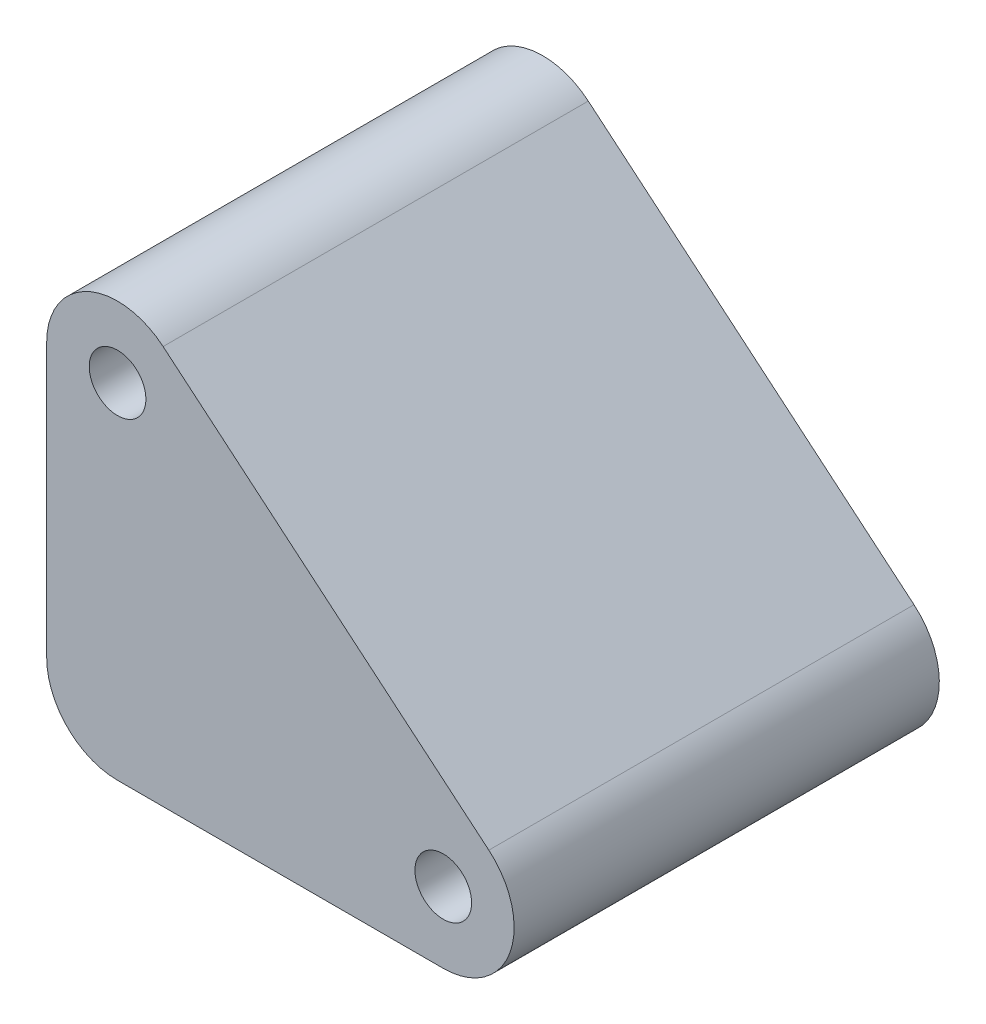
ISO-10303-21;
HEADER;
FILE_DESCRIPTION(('STEP AP214'),'2;1');
FILE_NAME('part.step','',(''),(''),'','','');
FILE_SCHEMA(('AUTOMOTIVE_DESIGN { 1 0 10303 214 1 1 1 1 }'));
ENDSEC;
DATA;
#1=APPLICATION_CONTEXT('core data for automotive mechanical design processes');
#2=APPLICATION_PROTOCOL_DEFINITION('international standard','automotive_design',2000,#1);
#3=PRODUCT_CONTEXT('',#1,'mechanical');
#4=PRODUCT('Part','Part','',(#3));
#5=PRODUCT_RELATED_PRODUCT_CATEGORY('part','',(#4));
#6=PRODUCT_DEFINITION_FORMATION('','',#4);
#7=PRODUCT_DEFINITION_CONTEXT('part definition',#1,'design');
#8=PRODUCT_DEFINITION('design','',#6,#7);
#9=PRODUCT_DEFINITION_SHAPE('','',#8);
#10=(LENGTH_UNIT() NAMED_UNIT(*) SI_UNIT(.MILLI.,.METRE.));
#11=(NAMED_UNIT(*) PLANE_ANGLE_UNIT() SI_UNIT($,.RADIAN.));
#12=(NAMED_UNIT(*) SI_UNIT($,.STERADIAN.) SOLID_ANGLE_UNIT());
#13=UNCERTAINTY_MEASURE_WITH_UNIT(LENGTH_MEASURE(1.E-05),#10,'distance_accuracy_value','');
#14=(GEOMETRIC_REPRESENTATION_CONTEXT(3) GLOBAL_UNCERTAINTY_ASSIGNED_CONTEXT((#13)) GLOBAL_UNIT_ASSIGNED_CONTEXT((#10,
#11,#12)) REPRESENTATION_CONTEXT('',''));
#15=CARTESIAN_POINT('',(0.,0.,0.));
#16=DIRECTION('',(0.,0.,1.));
#17=DIRECTION('',(1.,0.,0.));
#18=AXIS2_PLACEMENT_3D('',#15,#16,#17);
#19=CARTESIAN_POINT('',(-253.944054728592,61.0658585954254,-15.));
#20=DIRECTION('',(0.,0.,1.));
#21=DIRECTION('',(1.,0.,0.));
#22=AXIS2_PLACEMENT_3D('',#19,#20,#21);
#23=CYLINDRICAL_SURFACE('',#22,5.00000000000001);
#24=DIRECTION('',(0.,0.,1.));
#25=VECTOR('',#24,1.);
#26=CARTESIAN_POINT('',(-258.944054728592,61.0658585954254,-15.));
#27=LINE('',#26,#25);
#28=CARTESIAN_POINT('',(-258.944054728592,61.0658585954254,-15.));
#29=VERTEX_POINT('',#28);
#30=CARTESIAN_POINT('',(-258.944054728592,61.0658585954254,15.));
#31=VERTEX_POINT('',#30);
#32=EDGE_CURVE('E36',#29,#31,#27,.T.);
#33=ORIENTED_EDGE('',*,*,#32,.T.);
#34=CARTESIAN_POINT('',(-253.944054728592,61.0658585954254,15.));
#35=DIRECTION('',(0.,0.,1.));
#36=DIRECTION('',(1.,0.,0.));
#37=AXIS2_PLACEMENT_3D('',#34,#35,#36);
#38=CIRCLE('',#37,5.00000000000001);
#39=CARTESIAN_POINT('',(-250.730116680159,64.8960808110203,15.));
#40=VERTEX_POINT('',#39);
#41=EDGE_CURVE('E85',#40,#31,#38,.T.);
#42=ORIENTED_EDGE('',*,*,#41,.F.);
#43=DIRECTION('',(0.,0.,1.));
#44=VECTOR('',#43,1.);
#45=CARTESIAN_POINT('',(-250.730116680159,64.8960808110203,-15.));
#46=LINE('',#45,#44);
#47=CARTESIAN_POINT('',(-250.730116680159,64.8960808110203,-15.));
#48=VERTEX_POINT('',#47);
#49=EDGE_CURVE('E11',#48,#40,#46,.T.);
#50=ORIENTED_EDGE('',*,*,#49,.F.);
#51=CARTESIAN_POINT('',(-253.944054728592,61.0658585954254,-15.));
#52=DIRECTION('',(0.,0.,1.));
#53=DIRECTION('',(1.,0.,0.));
#54=AXIS2_PLACEMENT_3D('',#51,#52,#53);
#55=CIRCLE('',#54,5.00000000000001);
#56=EDGE_CURVE('E86',#48,#29,#55,.T.);
#57=ORIENTED_EDGE('',*,*,#56,.T.);
#58=EDGE_LOOP('',(#33,#42,#50,#57));
#59=FACE_BOUND('',#58,.T.);
#60=ADVANCED_FACE('F33',(#59),#23,.T.);
#61=CARTESIAN_POINT('',(-250.730116680159,64.8960808110203,-15.));
#62=DIRECTION('',(0.642787609686541,0.766044443118977,0.));
#63=DIRECTION('',(-0.766044443118977,0.642787609686541,0.));
#64=AXIS2_PLACEMENT_3D('',#61,#62,#63);
#65=PLANE('',#64);
#66=ORIENTED_EDGE('',*,*,#49,.T.);
#67=DIRECTION('',(-0.766044443118977,0.642787609686541,0.));
#68=VECTOR('',#67,1.);
#69=CARTESIAN_POINT('',(-250.730116680159,64.8960808110203,15.));
#70=LINE('',#69,#68);
#71=CARTESIAN_POINT('',(-227.74878338659,45.6124525204241,15.));
#72=VERTEX_POINT('',#71);
#73=EDGE_CURVE('E104',#72,#40,#70,.T.);
#74=ORIENTED_EDGE('',*,*,#73,.F.);
#75=DIRECTION('',(0.,0.,1.));
#76=VECTOR('',#75,1.);
#77=CARTESIAN_POINT('',(-227.74878338659,45.6124525204241,-15.));
#78=LINE('',#77,#76);
#79=CARTESIAN_POINT('',(-227.74878338659,45.6124525204241,-15.));
#80=VERTEX_POINT('',#79);
#81=EDGE_CURVE('E41',#80,#72,#78,.T.);
#82=ORIENTED_EDGE('',*,*,#81,.F.);
#83=DIRECTION('',(-0.766044443118977,0.642787609686541,0.));
#84=VECTOR('',#83,1.);
#85=CARTESIAN_POINT('',(-250.730116680159,64.8960808110203,-15.));
#86=LINE('',#85,#84);
#87=EDGE_CURVE('E91',#80,#48,#86,.T.);
#88=ORIENTED_EDGE('',*,*,#87,.T.);
#89=EDGE_LOOP('',(#66,#74,#82,#88));
#90=FACE_BOUND('',#89,.T.);
#91=ADVANCED_FACE('F155',(#90),#65,.T.);
#92=CARTESIAN_POINT('',(-230.962721435023,41.7822303048292,-15.));
#93=DIRECTION('',(0.,0.,1.));
#94=DIRECTION('',(1.,0.,0.));
#95=AXIS2_PLACEMENT_3D('',#92,#93,#94);
#96=CYLINDRICAL_SURFACE('',#95,5.);
#97=ORIENTED_EDGE('',*,*,#81,.T.);
#98=CARTESIAN_POINT('',(-230.962721435023,41.7822303048292,15.));
#99=DIRECTION('',(0.,0.,1.));
#100=DIRECTION('',(1.,0.,0.));
#101=AXIS2_PLACEMENT_3D('',#98,#99,#100);
#102=CIRCLE('',#101,5.);
#103=CARTESIAN_POINT('',(-230.962721435023,36.7822303048292,15.));
#104=VERTEX_POINT('',#103);
#105=EDGE_CURVE('E116',#104,#72,#102,.T.);
#106=ORIENTED_EDGE('',*,*,#105,.F.);
#107=DIRECTION('',(0.,0.,1.));
#108=VECTOR('',#107,1.);
#109=CARTESIAN_POINT('',(-230.962721435023,36.7822303048292,-15.));
#110=LINE('',#109,#108);
#111=CARTESIAN_POINT('',(-230.962721435023,36.7822303048292,-15.));
#112=VERTEX_POINT('',#111);
#113=EDGE_CURVE('E138',#112,#104,#110,.T.);
#114=ORIENTED_EDGE('',*,*,#113,.F.);
#115=CARTESIAN_POINT('',(-230.962721435023,41.7822303048292,-15.));
#116=DIRECTION('',(0.,0.,1.));
#117=DIRECTION('',(1.,0.,0.));
#118=AXIS2_PLACEMENT_3D('',#115,#116,#117);
#119=CIRCLE('',#118,5.);
#120=EDGE_CURVE('E134',#112,#80,#119,.T.);
#121=ORIENTED_EDGE('',*,*,#120,.T.);
#122=EDGE_LOOP('',(#97,#106,#114,#121));
#123=FACE_BOUND('',#122,.T.);
#124=ADVANCED_FACE('F151',(#123),#96,.T.);
#125=CARTESIAN_POINT('',(-230.962721435023,36.7822303048292,-15.));
#126=DIRECTION('',(0.,-1.,0.));
#127=DIRECTION('',(0.,0.,-1.));
#128=AXIS2_PLACEMENT_3D('',#125,#126,#127);
#129=PLANE('',#128);
#130=ORIENTED_EDGE('',*,*,#113,.T.);
#131=DIRECTION('',(1.,0.,0.));
#132=VECTOR('',#131,1.);
#133=CARTESIAN_POINT('',(-230.962721435023,36.7822303048292,15.));
#134=LINE('',#133,#132);
#135=CARTESIAN_POINT('',(-253.944054728592,36.7822303048292,15.));
#136=VERTEX_POINT('',#135);
#137=EDGE_CURVE('E113',#136,#104,#134,.T.);
#138=ORIENTED_EDGE('',*,*,#137,.F.);
#139=DIRECTION('',(0.,0.,1.));
#140=VECTOR('',#139,1.);
#141=CARTESIAN_POINT('',(-253.944054728592,36.7822303048292,-15.));
#142=LINE('',#141,#140);
#143=CARTESIAN_POINT('',(-253.944054728592,36.7822303048292,-15.));
#144=VERTEX_POINT('',#143);
#145=EDGE_CURVE('E140',#144,#136,#142,.T.);
#146=ORIENTED_EDGE('',*,*,#145,.F.);
#147=DIRECTION('',(1.,0.,0.));
#148=VECTOR('',#147,1.);
#149=CARTESIAN_POINT('',(-230.962721435023,36.7822303048292,-15.));
#150=LINE('',#149,#148);
#151=EDGE_CURVE('E131',#144,#112,#150,.T.);
#152=ORIENTED_EDGE('',*,*,#151,.T.);
#153=EDGE_LOOP('',(#130,#138,#146,#152));
#154=FACE_BOUND('',#153,.T.);
#155=ADVANCED_FACE('F148',(#154),#129,.T.);
#156=CARTESIAN_POINT('',(-253.944054728592,41.7822303048291,-15.));
#157=DIRECTION('',(0.,0.,1.));
#158=DIRECTION('',(1.,0.,0.));
#159=AXIS2_PLACEMENT_3D('',#156,#157,#158);
#160=CYLINDRICAL_SURFACE('',#159,4.99999999999995);
#161=ORIENTED_EDGE('',*,*,#145,.T.);
#162=CARTESIAN_POINT('',(-253.944054728592,41.7822303048291,15.));
#163=DIRECTION('',(0.,0.,1.));
#164=DIRECTION('',(1.,0.,0.));
#165=AXIS2_PLACEMENT_3D('',#162,#163,#164);
#166=CIRCLE('',#165,4.99999999999995);
#167=CARTESIAN_POINT('',(-258.944054728592,41.7822303048291,15.));
#168=VERTEX_POINT('',#167);
#169=EDGE_CURVE('E98',#168,#136,#166,.T.);
#170=ORIENTED_EDGE('',*,*,#169,.F.);
#171=DIRECTION('',(0.,0.,1.));
#172=VECTOR('',#171,1.);
#173=CARTESIAN_POINT('',(-258.944054728592,41.7822303048291,-15.));
#174=LINE('',#173,#172);
#175=CARTESIAN_POINT('',(-258.944054728592,41.7822303048291,-15.));
#176=VERTEX_POINT('',#175);
#177=EDGE_CURVE('E90',#176,#168,#174,.T.);
#178=ORIENTED_EDGE('',*,*,#177,.F.);
#179=CARTESIAN_POINT('',(-253.944054728592,41.7822303048291,-15.));
#180=DIRECTION('',(0.,0.,1.));
#181=DIRECTION('',(1.,0.,0.));
#182=AXIS2_PLACEMENT_3D('',#179,#180,#181);
#183=CIRCLE('',#182,4.99999999999995);
#184=EDGE_CURVE('E128',#176,#144,#183,.T.);
#185=ORIENTED_EDGE('',*,*,#184,.T.);
#186=EDGE_LOOP('',(#161,#170,#178,#185));
#187=FACE_BOUND('',#186,.T.);
#188=ADVANCED_FACE('F142',(#187),#160,.T.);
#189=CARTESIAN_POINT('',(-258.944054728592,41.7822303048291,-15.));
#190=DIRECTION('',(-1.,0.,0.));
#191=DIRECTION('',(0.,0.,1.));
#192=AXIS2_PLACEMENT_3D('',#189,#190,#191);
#193=PLANE('',#192);
#194=ORIENTED_EDGE('',*,*,#177,.T.);
#195=DIRECTION('',(0.,-1.,0.));
#196=VECTOR('',#195,1.);
#197=CARTESIAN_POINT('',(-258.944054728592,41.7822303048291,15.));
#198=LINE('',#197,#196);
#199=EDGE_CURVE('E93',#31,#168,#198,.T.);
#200=ORIENTED_EDGE('',*,*,#199,.F.);
#201=ORIENTED_EDGE('',*,*,#32,.F.);
#202=DIRECTION('',(0.,-1.,0.));
#203=VECTOR('',#202,1.);
#204=CARTESIAN_POINT('',(-258.944054728592,41.7822303048291,-15.));
#205=LINE('',#204,#203);
#206=EDGE_CURVE('E126',#29,#176,#205,.T.);
#207=ORIENTED_EDGE('',*,*,#206,.T.);
#208=EDGE_LOOP('',(#194,#200,#201,#207));
#209=FACE_BOUND('',#208,.T.);
#210=ADVANCED_FACE('F94',(#209),#193,.T.);
#211=CARTESIAN_POINT('',(-253.944054728592,61.0658585954254,-15.));
#212=DIRECTION('',(0.,0.,1.));
#213=DIRECTION('',(1.,0.,0.));
#214=AXIS2_PLACEMENT_3D('',#211,#212,#213);
#215=PLANE('',#214);
#216=CARTESIAN_POINT('',(-230.962721435023,41.7822303048292,-15.));
#217=DIRECTION('',(0.,0.,1.));
#218=DIRECTION('',(1.,0.,0.));
#219=AXIS2_PLACEMENT_3D('',#216,#217,#218);
#220=CIRCLE('',#219,2.);
#221=CARTESIAN_POINT('',(-228.962721435023,41.7822303048292,-15.));
#222=VERTEX_POINT('',#221);
#223=EDGE_CURVE('E119',#222,#222,#220,.T.);
#224=ORIENTED_EDGE('',*,*,#223,.T.);
#225=EDGE_LOOP('',(#224));
#226=FACE_BOUND('',#225,.T.);
#227=CARTESIAN_POINT('',(-253.944054728592,61.0658585954254,-15.));
#228=DIRECTION('',(0.,0.,1.));
#229=DIRECTION('',(1.,0.,0.));
#230=AXIS2_PLACEMENT_3D('',#227,#228,#229);
#231=CIRCLE('',#230,2.);
#232=CARTESIAN_POINT('',(-251.944054728592,61.0658585954254,-15.));
#233=VERTEX_POINT('',#232);
#234=EDGE_CURVE('E122',#233,#233,#231,.T.);
#235=ORIENTED_EDGE('',*,*,#234,.T.);
#236=EDGE_LOOP('',(#235));
#237=FACE_BOUND('',#236,.T.);
#238=ORIENTED_EDGE('',*,*,#56,.F.);
#239=ORIENTED_EDGE('',*,*,#87,.F.);
#240=ORIENTED_EDGE('',*,*,#120,.F.);
#241=ORIENTED_EDGE('',*,*,#151,.F.);
#242=ORIENTED_EDGE('',*,*,#184,.F.);
#243=ORIENTED_EDGE('',*,*,#206,.F.);
#244=EDGE_LOOP('',(#238,#239,#240,#241,#242,#243));
#245=FACE_BOUND('',#244,.T.);
#246=ADVANCED_FACE('F154',(#226,#237,#245),#215,.F.);
#247=CARTESIAN_POINT('',(-253.944054728592,61.0658585954254,-15.));
#248=DIRECTION('',(0.,0.,1.));
#249=DIRECTION('',(1.,0.,0.));
#250=AXIS2_PLACEMENT_3D('',#247,#248,#249);
#251=CYLINDRICAL_SURFACE('',#250,2.);
#252=ORIENTED_EDGE('',*,*,#234,.F.);
#253=EDGE_LOOP('',(#252));
#254=FACE_BOUND('',#253,.T.);
#255=CARTESIAN_POINT('',(-253.944054728592,61.0658585954254,15.));
#256=DIRECTION('',(0.,0.,1.));
#257=DIRECTION('',(1.,0.,0.));
#258=AXIS2_PLACEMENT_3D('',#255,#256,#257);
#259=CIRCLE('',#258,2.);
#260=CARTESIAN_POINT('',(-251.944054728592,61.0658585954254,15.));
#261=VERTEX_POINT('',#260);
#262=EDGE_CURVE('E105',#261,#261,#259,.T.);
#263=ORIENTED_EDGE('',*,*,#262,.T.);
#264=EDGE_LOOP('',(#263));
#265=FACE_BOUND('',#264,.T.);
#266=ADVANCED_FACE('F173',(#254,#265),#251,.F.);
#267=CARTESIAN_POINT('',(-230.962721435023,41.7822303048292,-15.));
#268=DIRECTION('',(0.,0.,1.));
#269=DIRECTION('',(1.,0.,0.));
#270=AXIS2_PLACEMENT_3D('',#267,#268,#269);
#271=CYLINDRICAL_SURFACE('',#270,2.);
#272=ORIENTED_EDGE('',*,*,#223,.F.);
#273=EDGE_LOOP('',(#272));
#274=FACE_BOUND('',#273,.T.);
#275=CARTESIAN_POINT('',(-230.962721435023,41.7822303048292,15.));
#276=DIRECTION('',(0.,0.,1.));
#277=DIRECTION('',(1.,0.,0.));
#278=AXIS2_PLACEMENT_3D('',#275,#276,#277);
#279=CIRCLE('',#278,2.);
#280=CARTESIAN_POINT('',(-228.962721435023,41.7822303048292,15.));
#281=VERTEX_POINT('',#280);
#282=EDGE_CURVE('E108',#281,#281,#279,.T.);
#283=ORIENTED_EDGE('',*,*,#282,.T.);
#284=EDGE_LOOP('',(#283));
#285=FACE_BOUND('',#284,.T.);
#286=ADVANCED_FACE('F178',(#274,#285),#271,.F.);
#287=CARTESIAN_POINT('',(-253.944054728592,61.0658585954254,15.));
#288=DIRECTION('',(0.,0.,1.));
#289=DIRECTION('',(1.,0.,0.));
#290=AXIS2_PLACEMENT_3D('',#287,#288,#289);
#291=PLANE('',#290);
#292=ORIENTED_EDGE('',*,*,#262,.F.);
#293=EDGE_LOOP('',(#292));
#294=FACE_BOUND('',#293,.T.);
#295=ORIENTED_EDGE('',*,*,#41,.T.);
#296=ORIENTED_EDGE('',*,*,#199,.T.);
#297=ORIENTED_EDGE('',*,*,#169,.T.);
#298=ORIENTED_EDGE('',*,*,#137,.T.);
#299=ORIENTED_EDGE('',*,*,#105,.T.);
#300=ORIENTED_EDGE('',*,*,#73,.T.);
#301=EDGE_LOOP('',(#295,#296,#297,#298,#299,#300));
#302=FACE_BOUND('',#301,.T.);
#303=ORIENTED_EDGE('',*,*,#282,.F.);
#304=EDGE_LOOP('',(#303));
#305=FACE_BOUND('',#304,.T.);
#306=ADVANCED_FACE('F101',(#294,#302,#305),#291,.T.);
#307=CLOSED_SHELL('',(#60,#91,#124,#155,#188,#210,#246,#266,#286,#306));
#308=MANIFOLD_SOLID_BREP('B2',#307);
#309=ADVANCED_BREP_SHAPE_REPRESENTATION('',(#18,#308),#14);
#310=SHAPE_DEFINITION_REPRESENTATION(#9,#309);
ENDSEC;
END-ISO-10303-21;
